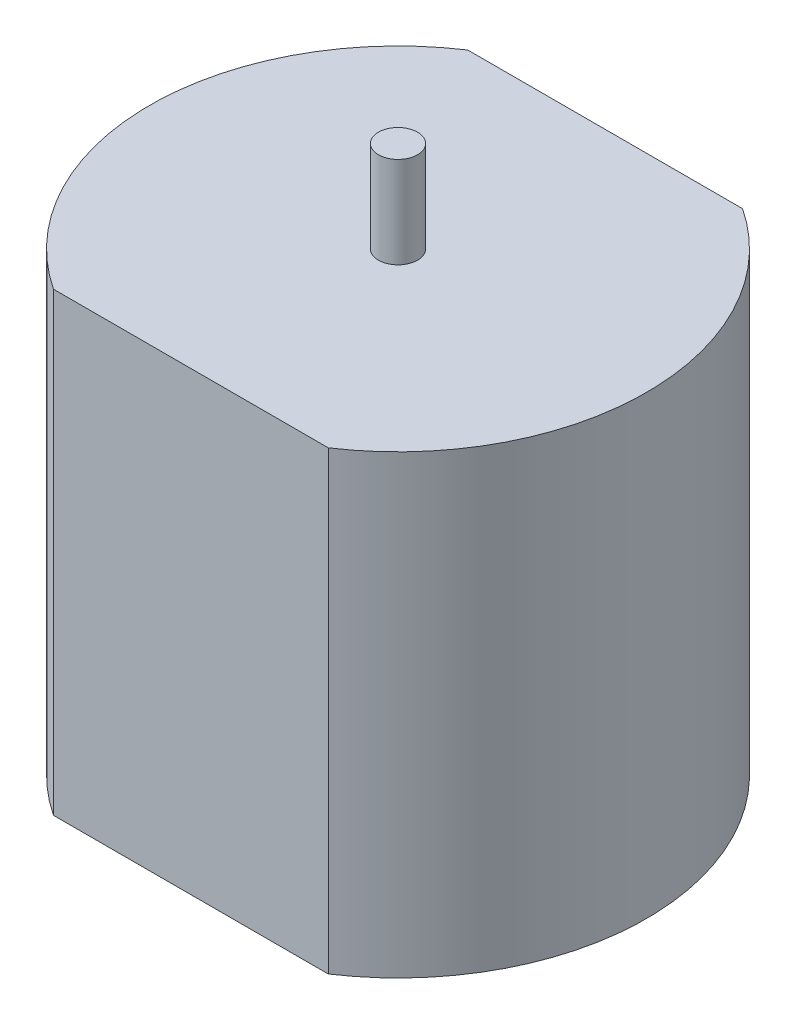
ISO-10303-21;
HEADER;
FILE_DESCRIPTION(('STEP AP214'),'2;1');
FILE_NAME('part.step','',(''),(''),'','','');
FILE_SCHEMA(('AUTOMOTIVE_DESIGN { 1 0 10303 214 1 1 1 1 }'));
ENDSEC;
DATA;
#1=APPLICATION_CONTEXT('core data for automotive mechanical design processes');
#2=APPLICATION_PROTOCOL_DEFINITION('international standard','automotive_design',2000,#1);
#3=PRODUCT_CONTEXT('',#1,'mechanical');
#4=PRODUCT('Part','Part','',(#3));
#5=PRODUCT_RELATED_PRODUCT_CATEGORY('part','',(#4));
#6=PRODUCT_DEFINITION_FORMATION('','',#4);
#7=PRODUCT_DEFINITION_CONTEXT('part definition',#1,'design');
#8=PRODUCT_DEFINITION('design','',#6,#7);
#9=PRODUCT_DEFINITION_SHAPE('','',#8);
#10=(LENGTH_UNIT() NAMED_UNIT(*) SI_UNIT(.MILLI.,.METRE.));
#11=(NAMED_UNIT(*) PLANE_ANGLE_UNIT() SI_UNIT($,.RADIAN.));
#12=(NAMED_UNIT(*) SI_UNIT($,.STERADIAN.) SOLID_ANGLE_UNIT());
#13=UNCERTAINTY_MEASURE_WITH_UNIT(LENGTH_MEASURE(1.E-05),#10,'distance_accuracy_value','');
#14=(GEOMETRIC_REPRESENTATION_CONTEXT(3) GLOBAL_UNCERTAINTY_ASSIGNED_CONTEXT((#13)) GLOBAL_UNIT_ASSIGNED_CONTEXT((#10,
#11,#12)) REPRESENTATION_CONTEXT('',''));
#15=CARTESIAN_POINT('',(0.,0.,0.));
#16=DIRECTION('',(0.,0.,1.));
#17=DIRECTION('',(1.,0.,0.));
#18=AXIS2_PLACEMENT_3D('',#15,#16,#17);
#19=CARTESIAN_POINT('',(0.,6.35,7.9375));
#20=DIRECTION('',(0.,0.,-1.));
#21=DIRECTION('',(-1.,0.,0.));
#22=AXIS2_PLACEMENT_3D('',#19,#20,#21);
#23=PLANE('',#22);
#24=DIRECTION('',(1.,0.,0.));
#25=VECTOR('',#24,1.);
#26=CARTESIAN_POINT('',(0.,0.,7.9375));
#27=LINE('',#26,#25);
#28=CARTESIAN_POINT('',(-5.2651418546892,0.,7.9375));
#29=VERTEX_POINT('',#28);
#30=CARTESIAN_POINT('',(5.2651418546892,0.,7.9375));
#31=VERTEX_POINT('',#30);
#32=EDGE_CURVE('E102',#29,#31,#27,.T.);
#33=ORIENTED_EDGE('',*,*,#32,.T.);
#34=DIRECTION('',(0.,-1.,0.));
#35=VECTOR('',#34,1.);
#36=CARTESIAN_POINT('',(5.2651418546892,6.35,7.9375));
#37=LINE('',#36,#35);
#38=CARTESIAN_POINT('',(5.2651418546892,17.4625,7.9375));
#39=VERTEX_POINT('',#38);
#40=EDGE_CURVE('E11',#39,#31,#37,.T.);
#41=ORIENTED_EDGE('',*,*,#40,.F.);
#42=DIRECTION('',(1.,0.,0.));
#43=VECTOR('',#42,1.);
#44=CARTESIAN_POINT('',(0.,17.4625,7.9375));
#45=LINE('',#44,#43);
#46=CARTESIAN_POINT('',(-5.2651418546892,17.4625,7.9375));
#47=VERTEX_POINT('',#46);
#48=EDGE_CURVE('E83',#47,#39,#45,.T.);
#49=ORIENTED_EDGE('',*,*,#48,.F.);
#50=DIRECTION('',(0.,-1.,0.));
#51=VECTOR('',#50,1.);
#52=CARTESIAN_POINT('',(-5.2651418546892,6.35,7.9375));
#53=LINE('',#52,#51);
#54=EDGE_CURVE('E73',#47,#29,#53,.T.);
#55=ORIENTED_EDGE('',*,*,#54,.T.);
#56=EDGE_LOOP('',(#33,#41,#49,#55));
#57=FACE_BOUND('',#56,.T.);
#58=ADVANCED_FACE('F38',(#57),#23,.F.);
#59=CARTESIAN_POINT('',(0.,6.35,0.));
#60=DIRECTION('',(0.,-1.,0.));
#61=DIRECTION('',(0.,0.,-1.));
#62=AXIS2_PLACEMENT_3D('',#59,#60,#61);
#63=CYLINDRICAL_SURFACE('',#62,9.525);
#64=CARTESIAN_POINT('',(0.,0.,0.));
#65=DIRECTION('',(0.,1.,0.));
#66=DIRECTION('',(0.,0.,1.));
#67=AXIS2_PLACEMENT_3D('',#64,#65,#66);
#68=CIRCLE('',#67,9.525);
#69=CARTESIAN_POINT('',(5.2651418546892,0.,-7.9375));
#70=VERTEX_POINT('',#69);
#71=EDGE_CURVE('E104',#31,#70,#68,.T.);
#72=ORIENTED_EDGE('',*,*,#71,.T.);
#73=DIRECTION('',(0.,-1.,0.));
#74=VECTOR('',#73,1.);
#75=CARTESIAN_POINT('',(5.2651418546892,6.35,-7.9375));
#76=LINE('',#75,#74);
#77=CARTESIAN_POINT('',(5.2651418546892,17.4625,-7.9375));
#78=VERTEX_POINT('',#77);
#79=EDGE_CURVE('E45',#78,#70,#76,.T.);
#80=ORIENTED_EDGE('',*,*,#79,.F.);
#81=CARTESIAN_POINT('',(0.,17.4625,0.));
#82=DIRECTION('',(0.,1.,0.));
#83=DIRECTION('',(0.,0.,1.));
#84=AXIS2_PLACEMENT_3D('',#81,#82,#83);
#85=CIRCLE('',#84,9.525);
#86=EDGE_CURVE('E87',#39,#78,#85,.T.);
#87=ORIENTED_EDGE('',*,*,#86,.F.);
#88=ORIENTED_EDGE('',*,*,#40,.T.);
#89=EDGE_LOOP('',(#72,#80,#87,#88));
#90=FACE_BOUND('',#89,.T.);
#91=ADVANCED_FACE('F115',(#90),#63,.T.);
#92=CARTESIAN_POINT('',(0.,6.35,-7.9375));
#93=DIRECTION('',(0.,0.,-1.));
#94=DIRECTION('',(-1.,0.,0.));
#95=AXIS2_PLACEMENT_3D('',#92,#93,#94);
#96=PLANE('',#95);
#97=DIRECTION('',(1.,0.,0.));
#98=VECTOR('',#97,1.);
#99=CARTESIAN_POINT('',(0.,0.,-7.9375));
#100=LINE('',#99,#98);
#101=CARTESIAN_POINT('',(-5.2651418546892,0.,-7.9375));
#102=VERTEX_POINT('',#101);
#103=EDGE_CURVE('E107',#102,#70,#100,.T.);
#104=ORIENTED_EDGE('',*,*,#103,.F.);
#105=DIRECTION('',(0.,-1.,0.));
#106=VECTOR('',#105,1.);
#107=CARTESIAN_POINT('',(-5.2651418546892,6.35,-7.9375));
#108=LINE('',#107,#106);
#109=CARTESIAN_POINT('',(-5.26514185468919,17.4625,-7.9375));
#110=VERTEX_POINT('',#109);
#111=EDGE_CURVE('E57',#110,#102,#108,.T.);
#112=ORIENTED_EDGE('',*,*,#111,.F.);
#113=DIRECTION('',(-1.,0.,0.));
#114=VECTOR('',#113,1.);
#115=CARTESIAN_POINT('',(0.,17.4625,-7.9375));
#116=LINE('',#115,#114);
#117=EDGE_CURVE('E92',#78,#110,#116,.T.);
#118=ORIENTED_EDGE('',*,*,#117,.F.);
#119=ORIENTED_EDGE('',*,*,#79,.T.);
#120=EDGE_LOOP('',(#104,#112,#118,#119));
#121=FACE_BOUND('',#120,.T.);
#122=ADVANCED_FACE('F113',(#121),#96,.T.);
#123=CARTESIAN_POINT('',(0.,6.35,0.));
#124=DIRECTION('',(0.,-1.,0.));
#125=DIRECTION('',(0.,0.,-1.));
#126=AXIS2_PLACEMENT_3D('',#123,#124,#125);
#127=CYLINDRICAL_SURFACE('',#126,9.525);
#128=CARTESIAN_POINT('',(0.,0.,0.));
#129=DIRECTION('',(0.,1.,0.));
#130=DIRECTION('',(0.,0.,1.));
#131=AXIS2_PLACEMENT_3D('',#128,#129,#130);
#132=CIRCLE('',#131,9.525);
#133=EDGE_CURVE('E52',#102,#29,#132,.T.);
#134=ORIENTED_EDGE('',*,*,#133,.T.);
#135=ORIENTED_EDGE('',*,*,#54,.F.);
#136=CARTESIAN_POINT('',(0.,17.4625,0.));
#137=DIRECTION('',(0.,1.,0.));
#138=DIRECTION('',(0.,0.,1.));
#139=AXIS2_PLACEMENT_3D('',#136,#137,#138);
#140=CIRCLE('',#139,9.525);
#141=EDGE_CURVE('E77',#110,#47,#140,.T.);
#142=ORIENTED_EDGE('',*,*,#141,.F.);
#143=ORIENTED_EDGE('',*,*,#111,.T.);
#144=EDGE_LOOP('',(#134,#135,#142,#143));
#145=FACE_BOUND('',#144,.T.);
#146=ADVANCED_FACE('F75',(#145),#127,.T.);
#147=CARTESIAN_POINT('',(0.,0.,0.));
#148=DIRECTION('',(0.,1.,0.));
#149=DIRECTION('',(0.,0.,1.));
#150=AXIS2_PLACEMENT_3D('',#147,#148,#149);
#151=PLANE('',#150);
#152=ORIENTED_EDGE('',*,*,#32,.F.);
#153=ORIENTED_EDGE('',*,*,#133,.F.);
#154=ORIENTED_EDGE('',*,*,#103,.T.);
#155=ORIENTED_EDGE('',*,*,#71,.F.);
#156=EDGE_LOOP('',(#152,#153,#154,#155));
#157=FACE_BOUND('',#156,.T.);
#158=ADVANCED_FACE('F117',(#157),#151,.F.);
#159=CARTESIAN_POINT('',(0.,17.4625,0.));
#160=DIRECTION('',(0.,1.,0.));
#161=DIRECTION('',(0.,0.,1.));
#162=AXIS2_PLACEMENT_3D('',#159,#160,#161);
#163=PLANE('',#162);
#164=CARTESIAN_POINT('',(0.,17.4625,0.));
#165=DIRECTION('',(0.,1.,0.));
#166=DIRECTION('',(0.,0.,1.));
#167=AXIS2_PLACEMENT_3D('',#164,#165,#166);
#168=CIRCLE('',#167,0.75);
#169=CARTESIAN_POINT('',(0.,17.4625,0.75));
#170=VERTEX_POINT('',#169);
#171=EDGE_CURVE('E96',#170,#170,#168,.T.);
#172=ORIENTED_EDGE('',*,*,#171,.F.);
#173=EDGE_LOOP('',(#172));
#174=FACE_BOUND('',#173,.T.);
#175=ORIENTED_EDGE('',*,*,#141,.T.);
#176=ORIENTED_EDGE('',*,*,#48,.T.);
#177=ORIENTED_EDGE('',*,*,#86,.T.);
#178=ORIENTED_EDGE('',*,*,#117,.T.);
#179=EDGE_LOOP('',(#175,#176,#177,#178));
#180=FACE_BOUND('',#179,.T.);
#181=ADVANCED_FACE('F90',(#174,#180),#163,.T.);
#182=CARTESIAN_POINT('',(0.,20.9625,0.));
#183=DIRECTION('',(0.,-1.,0.));
#184=DIRECTION('',(0.,0.,-1.));
#185=AXIS2_PLACEMENT_3D('',#182,#183,#184);
#186=CYLINDRICAL_SURFACE('',#185,0.75);
#187=CARTESIAN_POINT('',(0.,20.9625,0.));
#188=DIRECTION('',(0.,1.,0.));
#189=DIRECTION('',(0.,0.,1.));
#190=AXIS2_PLACEMENT_3D('',#187,#188,#189);
#191=CIRCLE('',#190,0.75);
#192=CARTESIAN_POINT('',(0.,20.9625,0.75));
#193=VERTEX_POINT('',#192);
#194=EDGE_CURVE('E93',#193,#193,#191,.T.);
#195=ORIENTED_EDGE('',*,*,#194,.F.);
#196=EDGE_LOOP('',(#195));
#197=FACE_BOUND('',#196,.T.);
#198=ORIENTED_EDGE('',*,*,#171,.T.);
#199=EDGE_LOOP('',(#198));
#200=FACE_BOUND('',#199,.T.);
#201=ADVANCED_FACE('F124',(#197,#200),#186,.T.);
#202=CARTESIAN_POINT('',(0.,20.9625,0.));
#203=DIRECTION('',(0.,1.,0.));
#204=DIRECTION('',(0.,0.,1.));
#205=AXIS2_PLACEMENT_3D('',#202,#203,#204);
#206=PLANE('',#205);
#207=ORIENTED_EDGE('',*,*,#194,.T.);
#208=EDGE_LOOP('',(#207));
#209=FACE_BOUND('',#208,.T.);
#210=ADVANCED_FACE('F160',(#209),#206,.T.);
#211=CLOSED_SHELL('',(#58,#91,#122,#146,#158,#181,#201,#210));
#212=MANIFOLD_SOLID_BREP('B2',#211);
#213=ADVANCED_BREP_SHAPE_REPRESENTATION('',(#18,#212),#14);
#214=SHAPE_DEFINITION_REPRESENTATION(#9,#213);
ENDSEC;
END-ISO-10303-21;
